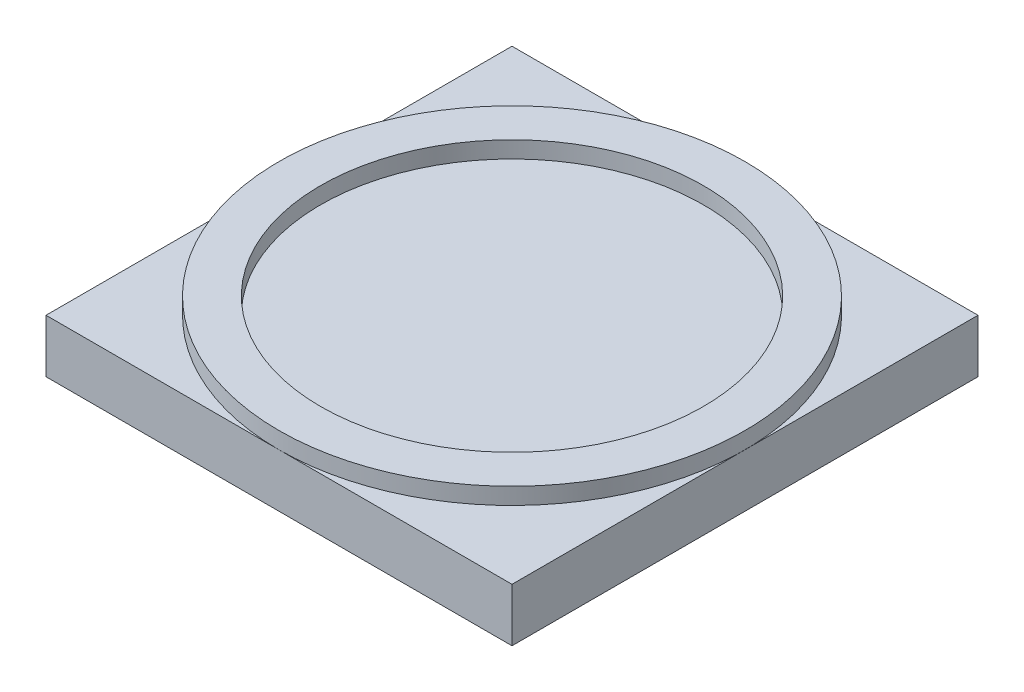
ISO-10303-21;
HEADER;
FILE_DESCRIPTION(('STEP AP214'),'2;1');
FILE_NAME('part.step','',(''),(''),'','','');
FILE_SCHEMA(('AUTOMOTIVE_DESIGN { 1 0 10303 214 1 1 1 1 }'));
ENDSEC;
DATA;
#1=APPLICATION_CONTEXT('core data for automotive mechanical design processes');
#2=APPLICATION_PROTOCOL_DEFINITION('international standard','automotive_design',2000,#1);
#3=PRODUCT_CONTEXT('',#1,'mechanical');
#4=PRODUCT('Part','Part','',(#3));
#5=PRODUCT_RELATED_PRODUCT_CATEGORY('part','',(#4));
#6=PRODUCT_DEFINITION_FORMATION('','',#4);
#7=PRODUCT_DEFINITION_CONTEXT('part definition',#1,'design');
#8=PRODUCT_DEFINITION('design','',#6,#7);
#9=PRODUCT_DEFINITION_SHAPE('','',#8);
#10=(LENGTH_UNIT() NAMED_UNIT(*) SI_UNIT(.MILLI.,.METRE.));
#11=(NAMED_UNIT(*) PLANE_ANGLE_UNIT() SI_UNIT($,.RADIAN.));
#12=(NAMED_UNIT(*) SI_UNIT($,.STERADIAN.) SOLID_ANGLE_UNIT());
#13=UNCERTAINTY_MEASURE_WITH_UNIT(LENGTH_MEASURE(1.E-05),#10,'distance_accuracy_value','');
#14=(GEOMETRIC_REPRESENTATION_CONTEXT(3) GLOBAL_UNCERTAINTY_ASSIGNED_CONTEXT((#13)) GLOBAL_UNIT_ASSIGNED_CONTEXT((#10,
#11,#12)) REPRESENTATION_CONTEXT('',''));
#15=CARTESIAN_POINT('',(0.,0.,0.));
#16=DIRECTION('',(0.,0.,1.));
#17=DIRECTION('',(1.,0.,0.));
#18=AXIS2_PLACEMENT_3D('',#15,#16,#17);
#19=CARTESIAN_POINT('',(0.,2.1,0.));
#20=DIRECTION('',(0.,1.,0.));
#21=DIRECTION('',(0.,0.,1.));
#22=AXIS2_PLACEMENT_3D('',#19,#20,#21);
#23=PLANE('',#22);
#24=CARTESIAN_POINT('',(0.,2.1,0.));
#25=DIRECTION('',(0.,1.,0.));
#26=DIRECTION('',(0.,0.,1.));
#27=AXIS2_PLACEMENT_3D('',#24,#25,#26);
#28=CIRCLE('',#27,7.);
#29=CARTESIAN_POINT('',(0.,2.1,7.));
#30=VERTEX_POINT('',#29);
#31=EDGE_CURVE('E11',#30,#30,#28,.T.);
#32=ORIENTED_EDGE('',*,*,#31,.T.);
#33=EDGE_LOOP('',(#32));
#34=FACE_BOUND('',#33,.T.);
#35=CARTESIAN_POINT('',(0.,2.1,0.));
#36=DIRECTION('',(0.,1.,0.));
#37=DIRECTION('',(0.,0.,1.));
#38=AXIS2_PLACEMENT_3D('',#35,#36,#37);
#39=CIRCLE('',#38,5.75);
#40=CARTESIAN_POINT('',(0.,2.1,5.75));
#41=VERTEX_POINT('',#40);
#42=EDGE_CURVE('E52',#41,#41,#39,.T.);
#43=ORIENTED_EDGE('',*,*,#42,.F.);
#44=EDGE_LOOP('',(#43));
#45=FACE_BOUND('',#44,.T.);
#46=ADVANCED_FACE('F41',(#34,#45),#23,.T.);
#47=CARTESIAN_POINT('',(0.,1.6,0.));
#48=DIRECTION('',(0.,1.,0.));
#49=DIRECTION('',(0.,0.,1.));
#50=AXIS2_PLACEMENT_3D('',#47,#48,#49);
#51=PLANE('',#50);
#52=CARTESIAN_POINT('',(0.,1.6,0.));
#53=DIRECTION('',(0.,1.,0.));
#54=DIRECTION('',(0.,0.,1.));
#55=AXIS2_PLACEMENT_3D('',#52,#53,#54);
#56=CIRCLE('',#55,7.);
#57=CARTESIAN_POINT('',(0.,1.6,7.));
#58=VERTEX_POINT('',#57);
#59=EDGE_CURVE('E45',#58,#58,#56,.T.);
#60=ORIENTED_EDGE('',*,*,#59,.F.);
#61=EDGE_LOOP('',(#60));
#62=FACE_BOUND('',#61,.T.);
#63=CARTESIAN_POINT('',(0.,1.6,0.));
#64=DIRECTION('',(0.,1.,0.));
#65=DIRECTION('',(0.,0.,1.));
#66=AXIS2_PLACEMENT_3D('',#63,#64,#65);
#67=CIRCLE('',#66,5.75);
#68=CARTESIAN_POINT('',(0.,1.6,5.75));
#69=VERTEX_POINT('',#68);
#70=EDGE_CURVE('E54',#69,#69,#67,.T.);
#71=ORIENTED_EDGE('',*,*,#70,.T.);
#72=EDGE_LOOP('',(#71));
#73=FACE_BOUND('',#72,.T.);
#74=ADVANCED_FACE('F64',(#62,#73),#51,.F.);
#75=CARTESIAN_POINT('',(0.,2.1,0.));
#76=DIRECTION('',(0.,-1.,0.));
#77=DIRECTION('',(0.,0.,-1.));
#78=AXIS2_PLACEMENT_3D('',#75,#76,#77);
#79=CYLINDRICAL_SURFACE('',#78,7.);
#80=ORIENTED_EDGE('',*,*,#31,.F.);
#81=EDGE_LOOP('',(#80));
#82=FACE_BOUND('',#81,.T.);
#83=ORIENTED_EDGE('',*,*,#59,.T.);
#84=EDGE_LOOP('',(#83));
#85=FACE_BOUND('',#84,.T.);
#86=ADVANCED_FACE('F43',(#82,#85),#79,.T.);
#87=CARTESIAN_POINT('',(0.,2.1,0.));
#88=DIRECTION('',(0.,-1.,0.));
#89=DIRECTION('',(0.,0.,-1.));
#90=AXIS2_PLACEMENT_3D('',#87,#88,#89);
#91=CYLINDRICAL_SURFACE('',#90,5.75);
#92=ORIENTED_EDGE('',*,*,#42,.T.);
#93=EDGE_LOOP('',(#92));
#94=FACE_BOUND('',#93,.T.);
#95=ORIENTED_EDGE('',*,*,#70,.F.);
#96=EDGE_LOOP('',(#95));
#97=FACE_BOUND('',#96,.T.);
#98=ADVANCED_FACE('F60',(#94,#97),#91,.F.);
#99=CLOSED_SHELL('',(#46,#74,#86,#98));
#100=MANIFOLD_SOLID_BREP('B2',#99);
#101=CARTESIAN_POINT('',(7.,1.6,7.));
#102=DIRECTION('',(-1.,0.,0.));
#103=DIRECTION('',(0.,0.,1.));
#104=AXIS2_PLACEMENT_3D('',#101,#102,#103);
#105=PLANE('',#104);
#106=DIRECTION('',(0.,0.,-1.));
#107=VECTOR('',#106,1.);
#108=CARTESIAN_POINT('',(7.,0.,7.));
#109=LINE('',#108,#107);
#110=CARTESIAN_POINT('',(7.,0.,7.));
#111=VERTEX_POINT('',#110);
#112=CARTESIAN_POINT('',(7.,0.,-7.));
#113=VERTEX_POINT('',#112);
#114=EDGE_CURVE('E166',#111,#113,#109,.T.);
#115=ORIENTED_EDGE('',*,*,#114,.T.);
#116=DIRECTION('',(0.,-1.,0.));
#117=VECTOR('',#116,1.);
#118=CARTESIAN_POINT('',(7.,1.6,-7.));
#119=LINE('',#118,#117);
#120=CARTESIAN_POINT('',(7.,1.6,-7.));
#121=VERTEX_POINT('',#120);
#122=EDGE_CURVE('E39',#121,#113,#119,.T.);
#123=ORIENTED_EDGE('',*,*,#122,.F.);
#124=DIRECTION('',(0.,0.,-1.));
#125=VECTOR('',#124,1.);
#126=CARTESIAN_POINT('',(7.,1.6,7.));
#127=LINE('',#126,#125);
#128=CARTESIAN_POINT('',(7.,1.6,7.));
#129=VERTEX_POINT('',#128);
#130=EDGE_CURVE('E154',#129,#121,#127,.T.);
#131=ORIENTED_EDGE('',*,*,#130,.F.);
#132=DIRECTION('',(0.,-1.,0.));
#133=VECTOR('',#132,1.);
#134=CARTESIAN_POINT('',(7.,1.6,7.));
#135=LINE('',#134,#133);
#136=EDGE_CURVE('E162',#129,#111,#135,.T.);
#137=ORIENTED_EDGE('',*,*,#136,.T.);
#138=EDGE_LOOP('',(#115,#123,#131,#137));
#139=FACE_BOUND('',#138,.T.);
#140=ADVANCED_FACE('F103',(#139),#105,.F.);
#141=CARTESIAN_POINT('',(-7.,1.6,-7.));
#142=DIRECTION('',(0.,0.,1.));
#143=DIRECTION('',(1.,0.,0.));
#144=AXIS2_PLACEMENT_3D('',#141,#142,#143);
#145=PLANE('',#144);
#146=DIRECTION('',(-1.,0.,0.));
#147=VECTOR('',#146,1.);
#148=CARTESIAN_POINT('',(-7.,0.,-7.));
#149=LINE('',#148,#147);
#150=CARTESIAN_POINT('',(-7.,0.,-7.));
#151=VERTEX_POINT('',#150);
#152=EDGE_CURVE('E158',#113,#151,#149,.T.);
#153=ORIENTED_EDGE('',*,*,#152,.T.);
#154=DIRECTION('',(0.,-1.,0.));
#155=VECTOR('',#154,1.);
#156=CARTESIAN_POINT('',(-7.,1.6,-7.));
#157=LINE('',#156,#155);
#158=CARTESIAN_POINT('',(-7.,1.6,-7.));
#159=VERTEX_POINT('',#158);
#160=EDGE_CURVE('E111',#159,#151,#157,.T.);
#161=ORIENTED_EDGE('',*,*,#160,.F.);
#162=DIRECTION('',(-1.,0.,0.));
#163=VECTOR('',#162,1.);
#164=CARTESIAN_POINT('',(-7.,1.6,-7.));
#165=LINE('',#164,#163);
#166=EDGE_CURVE('E149',#121,#159,#165,.T.);
#167=ORIENTED_EDGE('',*,*,#166,.F.);
#168=ORIENTED_EDGE('',*,*,#122,.T.);
#169=EDGE_LOOP('',(#153,#161,#167,#168));
#170=FACE_BOUND('',#169,.T.);
#171=ADVANCED_FACE('F157',(#170),#145,.F.);
#172=CARTESIAN_POINT('',(-7.,1.6,7.));
#173=DIRECTION('',(1.,0.,0.));
#174=DIRECTION('',(0.,0.,-1.));
#175=AXIS2_PLACEMENT_3D('',#172,#173,#174);
#176=PLANE('',#175);
#177=DIRECTION('',(0.,0.,1.));
#178=VECTOR('',#177,1.);
#179=CARTESIAN_POINT('',(-7.,0.,7.));
#180=LINE('',#179,#178);
#181=CARTESIAN_POINT('',(-7.,0.,7.));
#182=VERTEX_POINT('',#181);
#183=EDGE_CURVE('E136',#151,#182,#180,.T.);
#184=ORIENTED_EDGE('',*,*,#183,.T.);
#185=DIRECTION('',(0.,-1.,0.));
#186=VECTOR('',#185,1.);
#187=CARTESIAN_POINT('',(-7.,1.6,7.));
#188=LINE('',#187,#186);
#189=CARTESIAN_POINT('',(-7.,1.6,7.));
#190=VERTEX_POINT('',#189);
#191=EDGE_CURVE('E159',#190,#182,#188,.T.);
#192=ORIENTED_EDGE('',*,*,#191,.F.);
#193=DIRECTION('',(0.,0.,1.));
#194=VECTOR('',#193,1.);
#195=CARTESIAN_POINT('',(-7.,1.6,7.));
#196=LINE('',#195,#194);
#197=EDGE_CURVE('E152',#159,#190,#196,.T.);
#198=ORIENTED_EDGE('',*,*,#197,.F.);
#199=ORIENTED_EDGE('',*,*,#160,.T.);
#200=EDGE_LOOP('',(#184,#192,#198,#199));
#201=FACE_BOUND('',#200,.T.);
#202=ADVANCED_FACE('F160',(#201),#176,.F.);
#203=CARTESIAN_POINT('',(-7.,1.6,7.));
#204=DIRECTION('',(0.,0.,-1.));
#205=DIRECTION('',(-1.,0.,0.));
#206=AXIS2_PLACEMENT_3D('',#203,#204,#205);
#207=PLANE('',#206);
#208=DIRECTION('',(1.,0.,0.));
#209=VECTOR('',#208,1.);
#210=CARTESIAN_POINT('',(-7.,0.,7.));
#211=LINE('',#210,#209);
#212=EDGE_CURVE('E142',#182,#111,#211,.T.);
#213=ORIENTED_EDGE('',*,*,#212,.T.);
#214=ORIENTED_EDGE('',*,*,#136,.F.);
#215=DIRECTION('',(1.,0.,0.));
#216=VECTOR('',#215,1.);
#217=CARTESIAN_POINT('',(-7.,1.6,7.));
#218=LINE('',#217,#216);
#219=EDGE_CURVE('E119',#190,#129,#218,.T.);
#220=ORIENTED_EDGE('',*,*,#219,.F.);
#221=ORIENTED_EDGE('',*,*,#191,.T.);
#222=EDGE_LOOP('',(#213,#214,#220,#221));
#223=FACE_BOUND('',#222,.T.);
#224=ADVANCED_FACE('F173',(#223),#207,.F.);
#225=CARTESIAN_POINT('',(0.,1.6,0.));
#226=DIRECTION('',(0.,-1.,0.));
#227=DIRECTION('',(0.,0.,-1.));
#228=AXIS2_PLACEMENT_3D('',#225,#226,#227);
#229=PLANE('',#228);
#230=ORIENTED_EDGE('',*,*,#130,.T.);
#231=ORIENTED_EDGE('',*,*,#166,.T.);
#232=ORIENTED_EDGE('',*,*,#197,.T.);
#233=ORIENTED_EDGE('',*,*,#219,.T.);
#234=EDGE_LOOP('',(#230,#231,#232,#233));
#235=FACE_BOUND('',#234,.T.);
#236=ADVANCED_FACE('F150',(#235),#229,.F.);
#237=CARTESIAN_POINT('',(0.,0.,0.));
#238=DIRECTION('',(0.,-1.,0.));
#239=DIRECTION('',(0.,0.,-1.));
#240=AXIS2_PLACEMENT_3D('',#237,#238,#239);
#241=PLANE('',#240);
#242=ORIENTED_EDGE('',*,*,#114,.F.);
#243=ORIENTED_EDGE('',*,*,#212,.F.);
#244=ORIENTED_EDGE('',*,*,#183,.F.);
#245=ORIENTED_EDGE('',*,*,#152,.F.);
#246=EDGE_LOOP('',(#242,#243,#244,#245));
#247=FACE_BOUND('',#246,.T.);
#248=ADVANCED_FACE('F176',(#247),#241,.T.);
#249=CLOSED_SHELL('',(#140,#171,#202,#224,#236,#248));
#250=MANIFOLD_SOLID_BREP('B6',#249);
#251=ADVANCED_BREP_SHAPE_REPRESENTATION('',(#18,#100,#250),#14);
#252=SHAPE_DEFINITION_REPRESENTATION(#9,#251);
ENDSEC;
END-ISO-10303-21;
